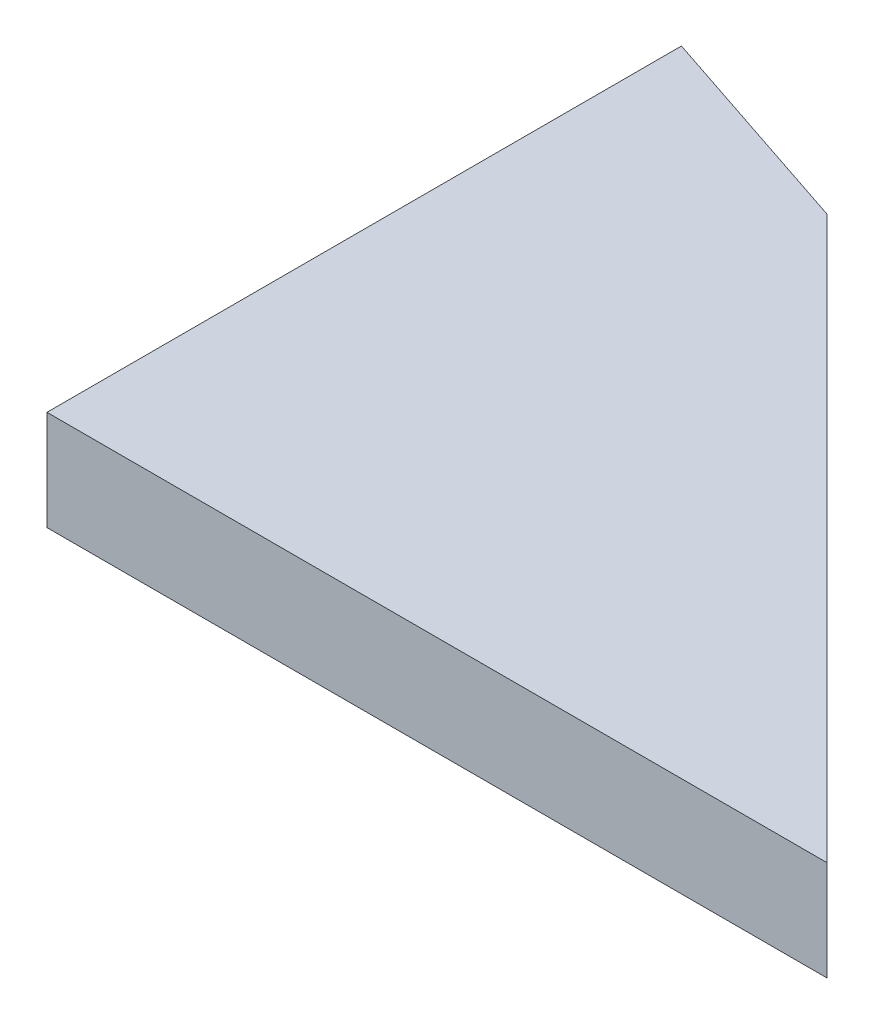
ISO-10303-21;
HEADER;
FILE_DESCRIPTION(('STEP AP214'),'2;1');
FILE_NAME('part.step','',(''),(''),'','','');
FILE_SCHEMA(('AUTOMOTIVE_DESIGN { 1 0 10303 214 1 1 1 1 }'));
ENDSEC;
DATA;
#1=APPLICATION_CONTEXT('core data for automotive mechanical design processes');
#2=APPLICATION_PROTOCOL_DEFINITION('international standard','automotive_design',2000,#1);
#3=PRODUCT_CONTEXT('',#1,'mechanical');
#4=PRODUCT('Part','Part','',(#3));
#5=PRODUCT_RELATED_PRODUCT_CATEGORY('part','',(#4));
#6=PRODUCT_DEFINITION_FORMATION('','',#4);
#7=PRODUCT_DEFINITION_CONTEXT('part definition',#1,'design');
#8=PRODUCT_DEFINITION('design','',#6,#7);
#9=PRODUCT_DEFINITION_SHAPE('','',#8);
#10=(LENGTH_UNIT() NAMED_UNIT(*) SI_UNIT(.MILLI.,.METRE.));
#11=(NAMED_UNIT(*) PLANE_ANGLE_UNIT() SI_UNIT($,.RADIAN.));
#12=(NAMED_UNIT(*) SI_UNIT($,.STERADIAN.) SOLID_ANGLE_UNIT());
#13=UNCERTAINTY_MEASURE_WITH_UNIT(LENGTH_MEASURE(1.E-05),#10,'distance_accuracy_value','');
#14=(GEOMETRIC_REPRESENTATION_CONTEXT(3) GLOBAL_UNCERTAINTY_ASSIGNED_CONTEXT((#13)) GLOBAL_UNIT_ASSIGNED_CONTEXT((#10,
#11,#12)) REPRESENTATION_CONTEXT('',''));
#15=CARTESIAN_POINT('',(0.,0.,0.));
#16=DIRECTION('',(0.,0.,1.));
#17=DIRECTION('',(1.,0.,0.));
#18=AXIS2_PLACEMENT_3D('',#15,#16,#17);
#19=CARTESIAN_POINT('',(0.,0.,0.));
#20=DIRECTION('',(0.,1.,0.));
#21=DIRECTION('',(0.,0.,1.));
#22=AXIS2_PLACEMENT_3D('',#19,#20,#21);
#23=PLANE('',#22);
#24=DIRECTION('',(-0.707106781186546,0.,-0.707106781186549));
#25=VECTOR('',#24,1.);
#26=CARTESIAN_POINT('',(50.0000000000002,0.,-50.));
#27=LINE('',#26,#25);
#28=CARTESIAN_POINT('',(100.,0.,0.));
#29=VERTEX_POINT('',#28);
#30=CARTESIAN_POINT('',(64.0000000000001,0.,-36.));
#31=VERTEX_POINT('',#30);
#32=EDGE_CURVE('E79',#29,#31,#27,.T.);
#33=ORIENTED_EDGE('',*,*,#32,.F.);
#34=DIRECTION('',(-1.,0.,0.));
#35=VECTOR('',#34,1.);
#36=CARTESIAN_POINT('',(0.,0.,0.));
#37=LINE('',#36,#35);
#38=CARTESIAN_POINT('',(50.,0.,0.));
#39=VERTEX_POINT('',#38);
#40=EDGE_CURVE('E68',#29,#39,#37,.T.);
#41=ORIENTED_EDGE('',*,*,#40,.T.);
#42=DIRECTION('',(0.,0.,-1.));
#43=VECTOR('',#42,1.);
#44=CARTESIAN_POINT('',(50.,0.,0.));
#45=LINE('',#44,#43);
#46=CARTESIAN_POINT('',(50.,0.,-40.6666666666668));
#47=VERTEX_POINT('',#46);
#48=EDGE_CURVE('E56',#39,#47,#45,.T.);
#49=ORIENTED_EDGE('',*,*,#48,.T.);
#50=DIRECTION('',(-0.948683298050513,0.,-0.316227766016841));
#51=VECTOR('',#50,1.);
#52=CARTESIAN_POINT('',(17.2000000000003,0.,-51.6000000000001));
#53=LINE('',#52,#51);
#54=EDGE_CURVE('E20',#31,#47,#53,.T.);
#55=ORIENTED_EDGE('',*,*,#54,.F.);
#56=EDGE_LOOP('',(#33,#41,#49,#55));
#57=FACE_BOUND('',#56,.T.);
#58=ADVANCED_FACE('F17',(#57),#23,.F.);
#59=CARTESIAN_POINT('',(17.2000000000003,6.4,-51.6000000000001));
#60=DIRECTION('',(0.316227766016841,0.,-0.948683298050513));
#61=DIRECTION('',(-0.948683298050513,0.,-0.316227766016841));
#62=AXIS2_PLACEMENT_3D('',#59,#60,#61);
#63=PLANE('',#62);
#64=DIRECTION('',(-0.948683298050513,0.,-0.316227766016841));
#65=VECTOR('',#64,1.);
#66=CARTESIAN_POINT('',(64.0000000000001,6.4,-36.));
#67=LINE('',#66,#65);
#68=CARTESIAN_POINT('',(64.0000000000001,6.4,-36.));
#69=VERTEX_POINT('',#68);
#70=CARTESIAN_POINT('',(50.,6.4,-40.6666666666668));
#71=VERTEX_POINT('',#70);
#72=EDGE_CURVE('E83',#69,#71,#67,.T.);
#73=ORIENTED_EDGE('',*,*,#72,.F.);
#74=DIRECTION('',(0.,1.,0.));
#75=VECTOR('',#74,1.);
#76=CARTESIAN_POINT('',(64.0000000000001,6.4,-36.));
#77=LINE('',#76,#75);
#78=EDGE_CURVE('E65',#31,#69,#77,.T.);
#79=ORIENTED_EDGE('',*,*,#78,.F.);
#80=ORIENTED_EDGE('',*,*,#54,.T.);
#81=DIRECTION('',(0.,1.,0.));
#82=VECTOR('',#81,1.);
#83=CARTESIAN_POINT('',(50.,6.4,-40.6666666666668));
#84=LINE('',#83,#82);
#85=EDGE_CURVE('E62',#47,#71,#84,.T.);
#86=ORIENTED_EDGE('',*,*,#85,.T.);
#87=EDGE_LOOP('',(#73,#79,#80,#86));
#88=FACE_BOUND('',#87,.T.);
#89=ADVANCED_FACE('F61',(#88),#63,.T.);
#90=CARTESIAN_POINT('',(50.,6.4,0.));
#91=DIRECTION('',(1.,0.,0.));
#92=DIRECTION('',(0.,0.,-1.));
#93=AXIS2_PLACEMENT_3D('',#90,#91,#92);
#94=PLANE('',#93);
#95=DIRECTION('',(0.,1.,0.));
#96=VECTOR('',#95,1.);
#97=CARTESIAN_POINT('',(50.,6.4,0.));
#98=LINE('',#97,#96);
#99=CARTESIAN_POINT('',(50.,6.4,0.));
#100=VERTEX_POINT('',#99);
#101=EDGE_CURVE('E70',#39,#100,#98,.T.);
#102=ORIENTED_EDGE('',*,*,#101,.T.);
#103=DIRECTION('',(0.,0.,1.));
#104=VECTOR('',#103,1.);
#105=CARTESIAN_POINT('',(50.,6.4,0.));
#106=LINE('',#105,#104);
#107=EDGE_CURVE('E74',#71,#100,#106,.T.);
#108=ORIENTED_EDGE('',*,*,#107,.F.);
#109=ORIENTED_EDGE('',*,*,#85,.F.);
#110=ORIENTED_EDGE('',*,*,#48,.F.);
#111=EDGE_LOOP('',(#102,#108,#109,#110));
#112=FACE_BOUND('',#111,.T.);
#113=ADVANCED_FACE('F72',(#112),#94,.F.);
#114=CARTESIAN_POINT('',(0.,6.4,0.));
#115=DIRECTION('',(0.,0.,-1.));
#116=DIRECTION('',(-1.,0.,0.));
#117=AXIS2_PLACEMENT_3D('',#114,#115,#116);
#118=PLANE('',#117);
#119=DIRECTION('',(0.,1.,0.));
#120=VECTOR('',#119,1.);
#121=CARTESIAN_POINT('',(100.,6.4,0.));
#122=LINE('',#121,#120);
#123=CARTESIAN_POINT('',(100.,6.4,0.));
#124=VERTEX_POINT('',#123);
#125=EDGE_CURVE('E35',#124,#29,#122,.F.);
#126=ORIENTED_EDGE('',*,*,#125,.F.);
#127=DIRECTION('',(1.,0.,0.));
#128=VECTOR('',#127,1.);
#129=CARTESIAN_POINT('',(0.,6.4,0.));
#130=LINE('',#129,#128);
#131=EDGE_CURVE('E26',#100,#124,#130,.T.);
#132=ORIENTED_EDGE('',*,*,#131,.F.);
#133=ORIENTED_EDGE('',*,*,#101,.F.);
#134=ORIENTED_EDGE('',*,*,#40,.F.);
#135=EDGE_LOOP('',(#126,#132,#133,#134));
#136=FACE_BOUND('',#135,.T.);
#137=ADVANCED_FACE('F89',(#136),#118,.F.);
#138=CARTESIAN_POINT('',(50.0000000000002,6.4,-50.));
#139=DIRECTION('',(0.707106781186549,0.,-0.707106781186546));
#140=DIRECTION('',(-0.707106781186546,0.,-0.707106781186549));
#141=AXIS2_PLACEMENT_3D('',#138,#139,#140);
#142=PLANE('',#141);
#143=DIRECTION('',(-0.707106781186546,0.,-0.707106781186549));
#144=VECTOR('',#143,1.);
#145=CARTESIAN_POINT('',(100.,6.4,0.));
#146=LINE('',#145,#144);
#147=EDGE_CURVE('E11',#124,#69,#146,.T.);
#148=ORIENTED_EDGE('',*,*,#147,.F.);
#149=ORIENTED_EDGE('',*,*,#125,.T.);
#150=ORIENTED_EDGE('',*,*,#32,.T.);
#151=ORIENTED_EDGE('',*,*,#78,.T.);
#152=EDGE_LOOP('',(#148,#149,#150,#151));
#153=FACE_BOUND('',#152,.T.);
#154=ADVANCED_FACE('F91',(#153),#142,.T.);
#155=CARTESIAN_POINT('',(0.,6.4,0.));
#156=DIRECTION('',(0.,1.,0.));
#157=DIRECTION('',(0.,0.,1.));
#158=AXIS2_PLACEMENT_3D('',#155,#156,#157);
#159=PLANE('',#158);
#160=ORIENTED_EDGE('',*,*,#131,.T.);
#161=ORIENTED_EDGE('',*,*,#147,.T.);
#162=ORIENTED_EDGE('',*,*,#72,.T.);
#163=ORIENTED_EDGE('',*,*,#107,.T.);
#164=EDGE_LOOP('',(#160,#161,#162,#163));
#165=FACE_BOUND('',#164,.T.);
#166=ADVANCED_FACE('F88',(#165),#159,.T.);
#167=CLOSED_SHELL('',(#58,#89,#113,#137,#154,#166));
#168=MANIFOLD_SOLID_BREP('B1',#167);
#169=ADVANCED_BREP_SHAPE_REPRESENTATION('',(#18,#168),#14);
#170=SHAPE_DEFINITION_REPRESENTATION(#9,#169);
ENDSEC;
END-ISO-10303-21;
